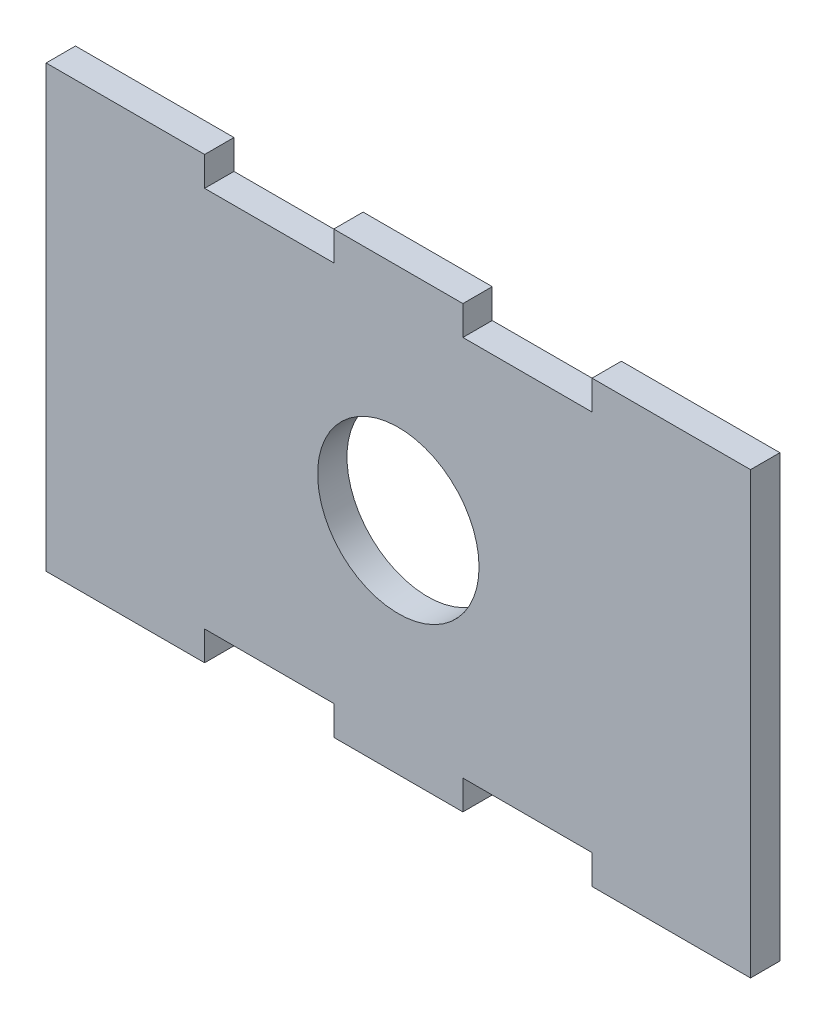
ISO-10303-21;
HEADER;
FILE_DESCRIPTION(('STEP AP214'),'2;1');
FILE_NAME('part.step','',(''),(''),'','','');
FILE_SCHEMA(('AUTOMOTIVE_DESIGN { 1 0 10303 214 1 1 1 1 }'));
ENDSEC;
DATA;
#1=APPLICATION_CONTEXT('core data for automotive mechanical design processes');
#2=APPLICATION_PROTOCOL_DEFINITION('international standard','automotive_design',2000,#1);
#3=PRODUCT_CONTEXT('',#1,'mechanical');
#4=PRODUCT('Part','Part','',(#3));
#5=PRODUCT_RELATED_PRODUCT_CATEGORY('part','',(#4));
#6=PRODUCT_DEFINITION_FORMATION('','',#4);
#7=PRODUCT_DEFINITION_CONTEXT('part definition',#1,'design');
#8=PRODUCT_DEFINITION('design','',#6,#7);
#9=PRODUCT_DEFINITION_SHAPE('','',#8);
#10=(LENGTH_UNIT() NAMED_UNIT(*) SI_UNIT(.MILLI.,.METRE.));
#11=(NAMED_UNIT(*) PLANE_ANGLE_UNIT() SI_UNIT($,.RADIAN.));
#12=(NAMED_UNIT(*) SI_UNIT($,.STERADIAN.) SOLID_ANGLE_UNIT());
#13=UNCERTAINTY_MEASURE_WITH_UNIT(LENGTH_MEASURE(1.E-05),#10,'distance_accuracy_value','');
#14=(GEOMETRIC_REPRESENTATION_CONTEXT(3) GLOBAL_UNCERTAINTY_ASSIGNED_CONTEXT((#13)) GLOBAL_UNIT_ASSIGNED_CONTEXT((#10,
#11,#12)) REPRESENTATION_CONTEXT('',''));
#15=CARTESIAN_POINT('',(0.,0.,0.));
#16=DIRECTION('',(0.,0.,1.));
#17=DIRECTION('',(1.,0.,0.));
#18=AXIS2_PLACEMENT_3D('',#15,#16,#17);
#19=CARTESIAN_POINT('',(0.,0.,4.));
#20=DIRECTION('',(0.,0.,-1.));
#21=DIRECTION('',(-1.,0.,0.));
#22=AXIS2_PLACEMENT_3D('',#19,#20,#21);
#23=PLANE('',#22);
#24=DIRECTION('',(-1.,0.,0.));
#25=VECTOR('',#24,1.);
#26=CARTESIAN_POINT('',(20.5241149653942,38.3611111111111,4.));
#27=LINE('',#26,#25);
#28=CARTESIAN_POINT('',(20.5241149653942,38.3611111111111,4.));
#29=VERTEX_POINT('',#28);
#30=CARTESIAN_POINT('',(2.92411496539427,38.3611111111111,4.));
#31=VERTEX_POINT('',#30);
#32=EDGE_CURVE('E318',#29,#31,#27,.T.);
#33=ORIENTED_EDGE('',*,*,#32,.T.);
#34=DIRECTION('',(0.,1.,0.));
#35=VECTOR('',#34,1.);
#36=CARTESIAN_POINT('',(2.92411496539427,38.3611111111111,4.));
#37=LINE('',#36,#35);
#38=CARTESIAN_POINT('',(2.92411496539427,42.3611111111111,4.));
#39=VERTEX_POINT('',#38);
#40=EDGE_CURVE('E190',#31,#39,#37,.T.);
#41=ORIENTED_EDGE('',*,*,#40,.T.);
#42=DIRECTION('',(1.,0.,0.));
#43=VECTOR('',#42,1.);
#44=CARTESIAN_POINT('',(-14.6758850346059,42.3611111111111,4.));
#45=LINE('',#44,#43);
#46=CARTESIAN_POINT('',(-14.6758850346059,42.3611111111111,4.));
#47=VERTEX_POINT('',#46);
#48=EDGE_CURVE('E358',#47,#39,#45,.T.);
#49=ORIENTED_EDGE('',*,*,#48,.F.);
#50=DIRECTION('',(0.,-1.,0.));
#51=VECTOR('',#50,1.);
#52=CARTESIAN_POINT('',(-14.6758850346059,42.3611111111111,4.));
#53=LINE('',#52,#51);
#54=CARTESIAN_POINT('',(-14.6758850346058,38.3611111111111,4.));
#55=VERTEX_POINT('',#54);
#56=EDGE_CURVE('E379',#47,#55,#53,.T.);
#57=ORIENTED_EDGE('',*,*,#56,.T.);
#58=DIRECTION('',(-1.,0.,0.));
#59=VECTOR('',#58,1.);
#60=CARTESIAN_POINT('',(-14.6758850346058,38.3611111111111,4.));
#61=LINE('',#60,#59);
#62=CARTESIAN_POINT('',(-32.2758850346057,38.3611111111111,4.));
#63=VERTEX_POINT('',#62);
#64=EDGE_CURVE('E376',#55,#63,#61,.T.);
#65=ORIENTED_EDGE('',*,*,#64,.T.);
#66=DIRECTION('',(0.,1.,0.));
#67=VECTOR('',#66,1.);
#68=CARTESIAN_POINT('',(-32.2758850346057,38.3611111111111,4.));
#69=LINE('',#68,#67);
#70=CARTESIAN_POINT('',(-32.2758850346057,42.3611111111111,4.));
#71=VERTEX_POINT('',#70);
#72=EDGE_CURVE('E378',#63,#71,#69,.T.);
#73=ORIENTED_EDGE('',*,*,#72,.T.);
#74=DIRECTION('',(1.,0.,0.));
#75=VECTOR('',#74,1.);
#76=CARTESIAN_POINT('',(-53.8758850346058,42.3611111111111,4.));
#77=LINE('',#76,#75);
#78=CARTESIAN_POINT('',(-53.8758850346058,42.3611111111111,4.));
#79=VERTEX_POINT('',#78);
#80=EDGE_CURVE('E381',#79,#71,#77,.T.);
#81=ORIENTED_EDGE('',*,*,#80,.F.);
#82=DIRECTION('',(0.,-1.,0.));
#83=VECTOR('',#82,1.);
#84=CARTESIAN_POINT('',(-53.8758850346058,42.3611111111111,4.));
#85=LINE('',#84,#83);
#86=CARTESIAN_POINT('',(-53.8758850346058,-17.6388888888889,4.));
#87=VERTEX_POINT('',#86);
#88=EDGE_CURVE('E388',#79,#87,#85,.T.);
#89=ORIENTED_EDGE('',*,*,#88,.T.);
#90=DIRECTION('',(1.,0.,0.));
#91=VECTOR('',#90,1.);
#92=CARTESIAN_POINT('',(-53.8758850346058,-17.6388888888889,4.));
#93=LINE('',#92,#91);
#94=CARTESIAN_POINT('',(-32.2758850346057,-17.6388888888889,4.));
#95=VERTEX_POINT('',#94);
#96=EDGE_CURVE('E390',#87,#95,#93,.T.);
#97=ORIENTED_EDGE('',*,*,#96,.T.);
#98=DIRECTION('',(0.,1.,0.));
#99=VECTOR('',#98,1.);
#100=CARTESIAN_POINT('',(-32.2758850346057,-17.6388888888889,4.));
#101=LINE('',#100,#99);
#102=CARTESIAN_POINT('',(-32.2758850346057,-13.6388888888889,4.));
#103=VERTEX_POINT('',#102);
#104=EDGE_CURVE('E392',#95,#103,#101,.T.);
#105=ORIENTED_EDGE('',*,*,#104,.T.);
#106=DIRECTION('',(-1.,0.,0.));
#107=VECTOR('',#106,1.);
#108=CARTESIAN_POINT('',(-14.6758850346058,-13.6388888888889,4.));
#109=LINE('',#108,#107);
#110=CARTESIAN_POINT('',(-14.6758850346058,-13.6388888888889,4.));
#111=VERTEX_POINT('',#110);
#112=EDGE_CURVE('E394',#111,#103,#109,.T.);
#113=ORIENTED_EDGE('',*,*,#112,.F.);
#114=DIRECTION('',(0.,1.,0.));
#115=VECTOR('',#114,1.);
#116=CARTESIAN_POINT('',(-14.6758850346058,-17.6388888888889,4.));
#117=LINE('',#116,#115);
#118=CARTESIAN_POINT('',(-14.6758850346058,-17.6388888888889,4.));
#119=VERTEX_POINT('',#118);
#120=EDGE_CURVE('E397',#119,#111,#117,.T.);
#121=ORIENTED_EDGE('',*,*,#120,.F.);
#122=DIRECTION('',(1.,0.,0.));
#123=VECTOR('',#122,1.);
#124=CARTESIAN_POINT('',(-14.6758850346058,-17.6388888888889,4.));
#125=LINE('',#124,#123);
#126=CARTESIAN_POINT('',(2.92411496539428,-17.6388888888889,4.));
#127=VERTEX_POINT('',#126);
#128=EDGE_CURVE('E400',#119,#127,#125,.T.);
#129=ORIENTED_EDGE('',*,*,#128,.T.);
#130=DIRECTION('',(0.,-1.,0.));
#131=VECTOR('',#130,1.);
#132=CARTESIAN_POINT('',(2.92411496539427,-13.6388888888889,4.));
#133=LINE('',#132,#131);
#134=CARTESIAN_POINT('',(2.92411496539427,-13.6388888888889,4.));
#135=VERTEX_POINT('',#134);
#136=EDGE_CURVE('E402',#135,#127,#133,.T.);
#137=ORIENTED_EDGE('',*,*,#136,.F.);
#138=DIRECTION('',(-1.,0.,0.));
#139=VECTOR('',#138,1.);
#140=CARTESIAN_POINT('',(20.5241149653942,-13.6388888888889,4.));
#141=LINE('',#140,#139);
#142=CARTESIAN_POINT('',(20.5241149653942,-13.6388888888889,4.));
#143=VERTEX_POINT('',#142);
#144=EDGE_CURVE('E405',#143,#135,#141,.T.);
#145=ORIENTED_EDGE('',*,*,#144,.F.);
#146=DIRECTION('',(0.,1.,0.));
#147=VECTOR('',#146,1.);
#148=CARTESIAN_POINT('',(20.5241149653942,-17.6388888888889,4.));
#149=LINE('',#148,#147);
#150=CARTESIAN_POINT('',(20.5241149653942,-17.6388888888889,4.));
#151=VERTEX_POINT('',#150);
#152=EDGE_CURVE('E408',#151,#143,#149,.T.);
#153=ORIENTED_EDGE('',*,*,#152,.F.);
#154=DIRECTION('',(1.,0.,0.));
#155=VECTOR('',#154,1.);
#156=CARTESIAN_POINT('',(20.5241149653942,-17.6388888888889,4.));
#157=LINE('',#156,#155);
#158=CARTESIAN_POINT('',(42.1241149653942,-17.6388888888889,4.));
#159=VERTEX_POINT('',#158);
#160=EDGE_CURVE('E257',#151,#159,#157,.T.);
#161=ORIENTED_EDGE('',*,*,#160,.T.);
#162=DIRECTION('',(0.,-1.,0.));
#163=VECTOR('',#162,1.);
#164=CARTESIAN_POINT('',(42.1241149653943,42.3611111111111,4.));
#165=LINE('',#164,#163);
#166=CARTESIAN_POINT('',(42.1241149653943,42.3611111111111,4.));
#167=VERTEX_POINT('',#166);
#168=EDGE_CURVE('E244',#167,#159,#165,.T.);
#169=ORIENTED_EDGE('',*,*,#168,.F.);
#170=DIRECTION('',(1.,0.,0.));
#171=VECTOR('',#170,1.);
#172=CARTESIAN_POINT('',(20.5241149653942,42.3611111111111,4.));
#173=LINE('',#172,#171);
#174=CARTESIAN_POINT('',(20.5241149653942,42.3611111111111,4.));
#175=VERTEX_POINT('',#174);
#176=EDGE_CURVE('E254',#175,#167,#173,.T.);
#177=ORIENTED_EDGE('',*,*,#176,.F.);
#178=DIRECTION('',(0.,-1.,0.));
#179=VECTOR('',#178,1.);
#180=CARTESIAN_POINT('',(20.5241149653942,42.3611111111111,4.));
#181=LINE('',#180,#179);
#182=EDGE_CURVE('E115',#175,#29,#181,.T.);
#183=ORIENTED_EDGE('',*,*,#182,.T.);
#184=EDGE_LOOP('',(#33,#41,#49,#57,#65,#73,#81,#89,#97,#105,#113,#121,#129,#137,#145,#153,#161,
#169,#177,#183));
#185=FACE_BOUND('',#184,.T.);
#186=CARTESIAN_POINT('',(-5.87588503460576,12.3611111111111,4.));
#187=DIRECTION('',(0.,0.,1.));
#188=DIRECTION('',(1.,0.,0.));
#189=AXIS2_PLACEMENT_3D('',#186,#187,#188);
#190=CIRCLE('',#189,11.);
#191=CARTESIAN_POINT('',(5.12411496539424,12.3611111111111,4.));
#192=VERTEX_POINT('',#191);
#193=EDGE_CURVE('E270',#192,#192,#190,.T.);
#194=ORIENTED_EDGE('',*,*,#193,.F.);
#195=EDGE_LOOP('',(#194));
#196=FACE_BOUND('',#195,.T.);
#197=ADVANCED_FACE('F98',(#185,#196),#23,.F.);
#198=CARTESIAN_POINT('',(0.,0.,0.));
#199=DIRECTION('',(0.,0.,-1.));
#200=DIRECTION('',(-1.,0.,0.));
#201=AXIS2_PLACEMENT_3D('',#198,#199,#200);
#202=PLANE('',#201);
#203=DIRECTION('',(-1.,0.,0.));
#204=VECTOR('',#203,1.);
#205=CARTESIAN_POINT('',(20.5241149653942,38.3611111111111,0.));
#206=LINE('',#205,#204);
#207=CARTESIAN_POINT('',(20.5241149653942,38.3611111111111,0.));
#208=VERTEX_POINT('',#207);
#209=CARTESIAN_POINT('',(2.92411496539427,38.3611111111111,0.));
#210=VERTEX_POINT('',#209);
#211=EDGE_CURVE('E266',#208,#210,#206,.T.);
#212=ORIENTED_EDGE('',*,*,#211,.F.);
#213=DIRECTION('',(0.,-1.,0.));
#214=VECTOR('',#213,1.);
#215=CARTESIAN_POINT('',(20.5241149653942,42.3611111111111,0.));
#216=LINE('',#215,#214);
#217=CARTESIAN_POINT('',(20.5241149653942,42.3611111111111,0.));
#218=VERTEX_POINT('',#217);
#219=EDGE_CURVE('E182',#218,#208,#216,.T.);
#220=ORIENTED_EDGE('',*,*,#219,.F.);
#221=DIRECTION('',(1.,0.,0.));
#222=VECTOR('',#221,1.);
#223=CARTESIAN_POINT('',(20.5241149653942,42.3611111111111,0.));
#224=LINE('',#223,#222);
#225=CARTESIAN_POINT('',(42.1241149653943,42.3611111111111,0.));
#226=VERTEX_POINT('',#225);
#227=EDGE_CURVE('E315',#218,#226,#224,.T.);
#228=ORIENTED_EDGE('',*,*,#227,.T.);
#229=DIRECTION('',(0.,-1.,0.));
#230=VECTOR('',#229,1.);
#231=CARTESIAN_POINT('',(42.1241149653943,42.3611111111111,0.));
#232=LINE('',#231,#230);
#233=CARTESIAN_POINT('',(42.1241149653942,-17.6388888888889,0.));
#234=VERTEX_POINT('',#233);
#235=EDGE_CURVE('E246',#226,#234,#232,.T.);
#236=ORIENTED_EDGE('',*,*,#235,.T.);
#237=DIRECTION('',(1.,0.,0.));
#238=VECTOR('',#237,1.);
#239=CARTESIAN_POINT('',(20.5241149653942,-17.6388888888889,0.));
#240=LINE('',#239,#238);
#241=CARTESIAN_POINT('',(20.5241149653942,-17.6388888888889,0.));
#242=VERTEX_POINT('',#241);
#243=EDGE_CURVE('E311',#242,#234,#240,.T.);
#244=ORIENTED_EDGE('',*,*,#243,.F.);
#245=DIRECTION('',(0.,1.,0.));
#246=VECTOR('',#245,1.);
#247=CARTESIAN_POINT('',(20.5241149653942,-17.6388888888889,0.));
#248=LINE('',#247,#246);
#249=CARTESIAN_POINT('',(20.5241149653942,-13.6388888888889,0.));
#250=VERTEX_POINT('',#249);
#251=EDGE_CURVE('E308',#242,#250,#248,.T.);
#252=ORIENTED_EDGE('',*,*,#251,.T.);
#253=DIRECTION('',(-1.,0.,0.));
#254=VECTOR('',#253,1.);
#255=CARTESIAN_POINT('',(20.5241149653942,-13.6388888888889,0.));
#256=LINE('',#255,#254);
#257=CARTESIAN_POINT('',(2.92411496539427,-13.6388888888889,0.));
#258=VERTEX_POINT('',#257);
#259=EDGE_CURVE('E305',#250,#258,#256,.T.);
#260=ORIENTED_EDGE('',*,*,#259,.T.);
#261=DIRECTION('',(0.,-1.,0.));
#262=VECTOR('',#261,1.);
#263=CARTESIAN_POINT('',(2.92411496539427,-13.6388888888889,0.));
#264=LINE('',#263,#262);
#265=CARTESIAN_POINT('',(2.92411496539428,-17.6388888888889,0.));
#266=VERTEX_POINT('',#265);
#267=EDGE_CURVE('E302',#258,#266,#264,.T.);
#268=ORIENTED_EDGE('',*,*,#267,.T.);
#269=DIRECTION('',(1.,0.,0.));
#270=VECTOR('',#269,1.);
#271=CARTESIAN_POINT('',(-14.6758850346058,-17.6388888888889,0.));
#272=LINE('',#271,#270);
#273=CARTESIAN_POINT('',(-14.6758850346058,-17.6388888888889,0.));
#274=VERTEX_POINT('',#273);
#275=EDGE_CURVE('E299',#274,#266,#272,.T.);
#276=ORIENTED_EDGE('',*,*,#275,.F.);
#277=DIRECTION('',(0.,1.,0.));
#278=VECTOR('',#277,1.);
#279=CARTESIAN_POINT('',(-14.6758850346058,-17.6388888888889,0.));
#280=LINE('',#279,#278);
#281=CARTESIAN_POINT('',(-14.6758850346058,-13.6388888888889,0.));
#282=VERTEX_POINT('',#281);
#283=EDGE_CURVE('E296',#274,#282,#280,.T.);
#284=ORIENTED_EDGE('',*,*,#283,.T.);
#285=DIRECTION('',(-1.,0.,0.));
#286=VECTOR('',#285,1.);
#287=CARTESIAN_POINT('',(-14.6758850346058,-13.6388888888889,0.));
#288=LINE('',#287,#286);
#289=CARTESIAN_POINT('',(-32.2758850346057,-13.6388888888889,0.));
#290=VERTEX_POINT('',#289);
#291=EDGE_CURVE('E293',#282,#290,#288,.T.);
#292=ORIENTED_EDGE('',*,*,#291,.T.);
#293=DIRECTION('',(0.,1.,0.));
#294=VECTOR('',#293,1.);
#295=CARTESIAN_POINT('',(-32.2758850346057,-17.6388888888889,0.));
#296=LINE('',#295,#294);
#297=CARTESIAN_POINT('',(-32.2758850346057,-17.6388888888889,0.));
#298=VERTEX_POINT('',#297);
#299=EDGE_CURVE('E290',#298,#290,#296,.T.);
#300=ORIENTED_EDGE('',*,*,#299,.F.);
#301=DIRECTION('',(1.,0.,0.));
#302=VECTOR('',#301,1.);
#303=CARTESIAN_POINT('',(-53.8758850346058,-17.6388888888889,0.));
#304=LINE('',#303,#302);
#305=CARTESIAN_POINT('',(-53.8758850346058,-17.6388888888889,0.));
#306=VERTEX_POINT('',#305);
#307=EDGE_CURVE('E288',#306,#298,#304,.T.);
#308=ORIENTED_EDGE('',*,*,#307,.F.);
#309=DIRECTION('',(0.,-1.,0.));
#310=VECTOR('',#309,1.);
#311=CARTESIAN_POINT('',(-53.8758850346058,42.3611111111111,0.));
#312=LINE('',#311,#310);
#313=CARTESIAN_POINT('',(-53.8758850346058,42.3611111111111,0.));
#314=VERTEX_POINT('',#313);
#315=EDGE_CURVE('E286',#314,#306,#312,.T.);
#316=ORIENTED_EDGE('',*,*,#315,.F.);
#317=DIRECTION('',(1.,0.,0.));
#318=VECTOR('',#317,1.);
#319=CARTESIAN_POINT('',(-53.8758850346058,42.3611111111111,0.));
#320=LINE('',#319,#318);
#321=CARTESIAN_POINT('',(-32.2758850346057,42.3611111111111,0.));
#322=VERTEX_POINT('',#321);
#323=EDGE_CURVE('E283',#314,#322,#320,.T.);
#324=ORIENTED_EDGE('',*,*,#323,.T.);
#325=DIRECTION('',(0.,1.,0.));
#326=VECTOR('',#325,1.);
#327=CARTESIAN_POINT('',(-32.2758850346057,38.3611111111111,0.));
#328=LINE('',#327,#326);
#329=CARTESIAN_POINT('',(-32.2758850346057,38.3611111111111,0.));
#330=VERTEX_POINT('',#329);
#331=EDGE_CURVE('E280',#330,#322,#328,.T.);
#332=ORIENTED_EDGE('',*,*,#331,.F.);
#333=DIRECTION('',(-1.,0.,0.));
#334=VECTOR('',#333,1.);
#335=CARTESIAN_POINT('',(-14.6758850346058,38.3611111111111,0.));
#336=LINE('',#335,#334);
#337=CARTESIAN_POINT('',(-14.6758850346058,38.3611111111111,0.));
#338=VERTEX_POINT('',#337);
#339=EDGE_CURVE('E278',#338,#330,#336,.T.);
#340=ORIENTED_EDGE('',*,*,#339,.F.);
#341=DIRECTION('',(0.,-1.,0.));
#342=VECTOR('',#341,1.);
#343=CARTESIAN_POINT('',(-14.6758850346059,42.3611111111111,0.));
#344=LINE('',#343,#342);
#345=CARTESIAN_POINT('',(-14.6758850346059,42.3611111111111,0.));
#346=VERTEX_POINT('',#345);
#347=EDGE_CURVE('E276',#346,#338,#344,.T.);
#348=ORIENTED_EDGE('',*,*,#347,.F.);
#349=DIRECTION('',(1.,0.,0.));
#350=VECTOR('',#349,1.);
#351=CARTESIAN_POINT('',(-14.6758850346059,42.3611111111111,0.));
#352=LINE('',#351,#350);
#353=CARTESIAN_POINT('',(2.92411496539427,42.3611111111111,0.));
#354=VERTEX_POINT('',#353);
#355=EDGE_CURVE('E273',#346,#354,#352,.T.);
#356=ORIENTED_EDGE('',*,*,#355,.T.);
#357=DIRECTION('',(0.,1.,0.));
#358=VECTOR('',#357,1.);
#359=CARTESIAN_POINT('',(2.92411496539427,38.3611111111111,0.));
#360=LINE('',#359,#358);
#361=EDGE_CURVE('E269',#210,#354,#360,.T.);
#362=ORIENTED_EDGE('',*,*,#361,.F.);
#363=EDGE_LOOP('',(#212,#220,#228,#236,#244,#252,#260,#268,#276,#284,#292,#300,#308,#316,#324,
#332,#340,#348,#356,#362));
#364=FACE_BOUND('',#363,.T.);
#365=CARTESIAN_POINT('',(-5.87588503460576,12.3611111111111,0.));
#366=DIRECTION('',(0.,0.,1.));
#367=DIRECTION('',(1.,0.,0.));
#368=AXIS2_PLACEMENT_3D('',#365,#366,#367);
#369=CIRCLE('',#368,11.);
#370=CARTESIAN_POINT('',(5.12411496539424,12.3611111111111,0.));
#371=VERTEX_POINT('',#370);
#372=EDGE_CURVE('E630',#371,#371,#369,.T.);
#373=ORIENTED_EDGE('',*,*,#372,.T.);
#374=EDGE_LOOP('',(#373));
#375=FACE_BOUND('',#374,.T.);
#376=ADVANCED_FACE('F364',(#364,#375),#202,.T.);
#377=CARTESIAN_POINT('',(20.5241149653942,38.3611111111111,4.));
#378=DIRECTION('',(0.,-1.,0.));
#379=DIRECTION('',(0.,0.,-1.));
#380=AXIS2_PLACEMENT_3D('',#377,#378,#379);
#381=PLANE('',#380);
#382=ORIENTED_EDGE('',*,*,#211,.T.);
#383=DIRECTION('',(0.,0.,-1.));
#384=VECTOR('',#383,1.);
#385=CARTESIAN_POINT('',(2.92411496539427,38.3611111111111,4.));
#386=LINE('',#385,#384);
#387=EDGE_CURVE('E12',#31,#210,#386,.T.);
#388=ORIENTED_EDGE('',*,*,#387,.F.);
#389=ORIENTED_EDGE('',*,*,#32,.F.);
#390=DIRECTION('',(0.,0.,-1.));
#391=VECTOR('',#390,1.);
#392=CARTESIAN_POINT('',(20.5241149653942,38.3611111111111,4.));
#393=LINE('',#392,#391);
#394=EDGE_CURVE('E262',#29,#208,#393,.T.);
#395=ORIENTED_EDGE('',*,*,#394,.T.);
#396=EDGE_LOOP('',(#382,#388,#389,#395));
#397=FACE_BOUND('',#396,.T.);
#398=ADVANCED_FACE('F100',(#397),#381,.F.);
#399=CARTESIAN_POINT('',(2.92411496539427,38.3611111111111,4.));
#400=DIRECTION('',(-1.,0.,0.));
#401=DIRECTION('',(0.,0.,1.));
#402=AXIS2_PLACEMENT_3D('',#399,#400,#401);
#403=PLANE('',#402);
#404=ORIENTED_EDGE('',*,*,#361,.T.);
#405=DIRECTION('',(0.,0.,-1.));
#406=VECTOR('',#405,1.);
#407=CARTESIAN_POINT('',(2.92411496539427,42.3611111111111,4.));
#408=LINE('',#407,#406);
#409=EDGE_CURVE('E107',#39,#354,#408,.T.);
#410=ORIENTED_EDGE('',*,*,#409,.F.);
#411=ORIENTED_EDGE('',*,*,#40,.F.);
#412=ORIENTED_EDGE('',*,*,#387,.T.);
#413=EDGE_LOOP('',(#404,#410,#411,#412));
#414=FACE_BOUND('',#413,.T.);
#415=ADVANCED_FACE('F359',(#414),#403,.F.);
#416=CARTESIAN_POINT('',(-14.6758850346059,42.3611111111111,4.));
#417=DIRECTION('',(0.,1.,0.));
#418=DIRECTION('',(0.,0.,1.));
#419=AXIS2_PLACEMENT_3D('',#416,#417,#418);
#420=PLANE('',#419);
#421=ORIENTED_EDGE('',*,*,#355,.F.);
#422=DIRECTION('',(0.,0.,-1.));
#423=VECTOR('',#422,1.);
#424=CARTESIAN_POINT('',(-14.6758850346059,42.3611111111111,4.));
#425=LINE('',#424,#423);
#426=EDGE_CURVE('E352',#47,#346,#425,.T.);
#427=ORIENTED_EDGE('',*,*,#426,.F.);
#428=ORIENTED_EDGE('',*,*,#48,.T.);
#429=ORIENTED_EDGE('',*,*,#409,.T.);
#430=EDGE_LOOP('',(#421,#427,#428,#429));
#431=FACE_BOUND('',#430,.T.);
#432=ADVANCED_FACE('F356',(#431),#420,.T.);
#433=CARTESIAN_POINT('',(-14.6758850346059,42.3611111111111,4.));
#434=DIRECTION('',(1.,0.,0.));
#435=DIRECTION('',(0.,1.,0.));
#436=AXIS2_PLACEMENT_3D('',#433,#434,#435);
#437=PLANE('',#436);
#438=ORIENTED_EDGE('',*,*,#347,.T.);
#439=DIRECTION('',(0.,0.,-1.));
#440=VECTOR('',#439,1.);
#441=CARTESIAN_POINT('',(-14.6758850346058,38.3611111111111,4.));
#442=LINE('',#441,#440);
#443=EDGE_CURVE('E349',#55,#338,#442,.T.);
#444=ORIENTED_EDGE('',*,*,#443,.F.);
#445=ORIENTED_EDGE('',*,*,#56,.F.);
#446=ORIENTED_EDGE('',*,*,#426,.T.);
#447=EDGE_LOOP('',(#438,#444,#445,#446));
#448=FACE_BOUND('',#447,.T.);
#449=ADVANCED_FACE('F370',(#448),#437,.F.);
#450=CARTESIAN_POINT('',(-14.6758850346058,38.3611111111111,4.));
#451=DIRECTION('',(0.,-1.,0.));
#452=DIRECTION('',(0.,0.,-1.));
#453=AXIS2_PLACEMENT_3D('',#450,#451,#452);
#454=PLANE('',#453);
#455=ORIENTED_EDGE('',*,*,#339,.T.);
#456=DIRECTION('',(0.,0.,-1.));
#457=VECTOR('',#456,1.);
#458=CARTESIAN_POINT('',(-32.2758850346057,38.3611111111111,4.));
#459=LINE('',#458,#457);
#460=EDGE_CURVE('E346',#63,#330,#459,.T.);
#461=ORIENTED_EDGE('',*,*,#460,.F.);
#462=ORIENTED_EDGE('',*,*,#64,.F.);
#463=ORIENTED_EDGE('',*,*,#443,.T.);
#464=EDGE_LOOP('',(#455,#461,#462,#463));
#465=FACE_BOUND('',#464,.T.);
#466=ADVANCED_FACE('F374',(#465),#454,.F.);
#467=CARTESIAN_POINT('',(-32.2758850346057,38.3611111111111,4.));
#468=DIRECTION('',(-1.,0.,0.));
#469=DIRECTION('',(0.,0.,1.));
#470=AXIS2_PLACEMENT_3D('',#467,#468,#469);
#471=PLANE('',#470);
#472=ORIENTED_EDGE('',*,*,#331,.T.);
#473=DIRECTION('',(0.,0.,-1.));
#474=VECTOR('',#473,1.);
#475=CARTESIAN_POINT('',(-32.2758850346057,42.3611111111111,4.));
#476=LINE('',#475,#474);
#477=EDGE_CURVE('E344',#71,#322,#476,.T.);
#478=ORIENTED_EDGE('',*,*,#477,.F.);
#479=ORIENTED_EDGE('',*,*,#72,.F.);
#480=ORIENTED_EDGE('',*,*,#460,.T.);
#481=EDGE_LOOP('',(#472,#478,#479,#480));
#482=FACE_BOUND('',#481,.T.);
#483=ADVANCED_FACE('F555',(#482),#471,.F.);
#484=CARTESIAN_POINT('',(-53.8758850346058,42.3611111111111,4.));
#485=DIRECTION('',(0.,1.,0.));
#486=DIRECTION('',(0.,0.,1.));
#487=AXIS2_PLACEMENT_3D('',#484,#485,#486);
#488=PLANE('',#487);
#489=ORIENTED_EDGE('',*,*,#323,.F.);
#490=DIRECTION('',(0.,0.,-1.));
#491=VECTOR('',#490,1.);
#492=CARTESIAN_POINT('',(-53.8758850346058,42.3611111111111,4.));
#493=LINE('',#492,#491);
#494=EDGE_CURVE('E342',#79,#314,#493,.T.);
#495=ORIENTED_EDGE('',*,*,#494,.F.);
#496=ORIENTED_EDGE('',*,*,#80,.T.);
#497=ORIENTED_EDGE('',*,*,#477,.T.);
#498=EDGE_LOOP('',(#489,#495,#496,#497));
#499=FACE_BOUND('',#498,.T.);
#500=ADVANCED_FACE('F546',(#499),#488,.T.);
#501=CARTESIAN_POINT('',(-53.8758850346058,42.3611111111111,4.));
#502=DIRECTION('',(1.,0.,0.));
#503=DIRECTION('',(0.,1.,0.));
#504=AXIS2_PLACEMENT_3D('',#501,#502,#503);
#505=PLANE('',#504);
#506=ORIENTED_EDGE('',*,*,#315,.T.);
#507=DIRECTION('',(0.,0.,-1.));
#508=VECTOR('',#507,1.);
#509=CARTESIAN_POINT('',(-53.8758850346058,-17.6388888888889,4.));
#510=LINE('',#509,#508);
#511=EDGE_CURVE('E339',#87,#306,#510,.T.);
#512=ORIENTED_EDGE('',*,*,#511,.F.);
#513=ORIENTED_EDGE('',*,*,#88,.F.);
#514=ORIENTED_EDGE('',*,*,#494,.T.);
#515=EDGE_LOOP('',(#506,#512,#513,#514));
#516=FACE_BOUND('',#515,.T.);
#517=ADVANCED_FACE('F537',(#516),#505,.F.);
#518=CARTESIAN_POINT('',(-53.8758850346058,-17.6388888888889,4.));
#519=DIRECTION('',(0.,1.,0.));
#520=DIRECTION('',(0.,0.,1.));
#521=AXIS2_PLACEMENT_3D('',#518,#519,#520);
#522=PLANE('',#521);
#523=ORIENTED_EDGE('',*,*,#307,.T.);
#524=DIRECTION('',(0.,0.,-1.));
#525=VECTOR('',#524,1.);
#526=CARTESIAN_POINT('',(-32.2758850346057,-17.6388888888889,4.));
#527=LINE('',#526,#525);
#528=EDGE_CURVE('E336',#95,#298,#527,.T.);
#529=ORIENTED_EDGE('',*,*,#528,.F.);
#530=ORIENTED_EDGE('',*,*,#96,.F.);
#531=ORIENTED_EDGE('',*,*,#511,.T.);
#532=EDGE_LOOP('',(#523,#529,#530,#531));
#533=FACE_BOUND('',#532,.T.);
#534=ADVANCED_FACE('F528',(#533),#522,.F.);
#535=CARTESIAN_POINT('',(-32.2758850346057,-17.6388888888889,4.));
#536=DIRECTION('',(-1.,0.,0.));
#537=DIRECTION('',(0.,0.,1.));
#538=AXIS2_PLACEMENT_3D('',#535,#536,#537);
#539=PLANE('',#538);
#540=ORIENTED_EDGE('',*,*,#299,.T.);
#541=DIRECTION('',(0.,0.,-1.));
#542=VECTOR('',#541,1.);
#543=CARTESIAN_POINT('',(-32.2758850346057,-13.6388888888889,4.));
#544=LINE('',#543,#542);
#545=EDGE_CURVE('E334',#103,#290,#544,.T.);
#546=ORIENTED_EDGE('',*,*,#545,.F.);
#547=ORIENTED_EDGE('',*,*,#104,.F.);
#548=ORIENTED_EDGE('',*,*,#528,.T.);
#549=EDGE_LOOP('',(#540,#546,#547,#548));
#550=FACE_BOUND('',#549,.T.);
#551=ADVANCED_FACE('F519',(#550),#539,.F.);
#552=CARTESIAN_POINT('',(-14.6758850346058,-13.6388888888889,4.));
#553=DIRECTION('',(0.,-1.,0.));
#554=DIRECTION('',(0.,0.,-1.));
#555=AXIS2_PLACEMENT_3D('',#552,#553,#554);
#556=PLANE('',#555);
#557=ORIENTED_EDGE('',*,*,#291,.F.);
#558=DIRECTION('',(0.,0.,-1.));
#559=VECTOR('',#558,1.);
#560=CARTESIAN_POINT('',(-14.6758850346058,-13.6388888888889,4.));
#561=LINE('',#560,#559);
#562=EDGE_CURVE('E332',#111,#282,#561,.T.);
#563=ORIENTED_EDGE('',*,*,#562,.F.);
#564=ORIENTED_EDGE('',*,*,#112,.T.);
#565=ORIENTED_EDGE('',*,*,#545,.T.);
#566=EDGE_LOOP('',(#557,#563,#564,#565));
#567=FACE_BOUND('',#566,.T.);
#568=ADVANCED_FACE('F510',(#567),#556,.T.);
#569=CARTESIAN_POINT('',(-14.6758850346058,-17.6388888888889,4.));
#570=DIRECTION('',(-1.,0.,0.));
#571=DIRECTION('',(0.,-1.,0.));
#572=AXIS2_PLACEMENT_3D('',#569,#570,#571);
#573=PLANE('',#572);
#574=ORIENTED_EDGE('',*,*,#283,.F.);
#575=DIRECTION('',(0.,0.,-1.));
#576=VECTOR('',#575,1.);
#577=CARTESIAN_POINT('',(-14.6758850346058,-17.6388888888889,4.));
#578=LINE('',#577,#576);
#579=EDGE_CURVE('E330',#119,#274,#578,.T.);
#580=ORIENTED_EDGE('',*,*,#579,.F.);
#581=ORIENTED_EDGE('',*,*,#120,.T.);
#582=ORIENTED_EDGE('',*,*,#562,.T.);
#583=EDGE_LOOP('',(#574,#580,#581,#582));
#584=FACE_BOUND('',#583,.T.);
#585=ADVANCED_FACE('F501',(#584),#573,.T.);
#586=CARTESIAN_POINT('',(-14.6758850346058,-17.6388888888889,4.));
#587=DIRECTION('',(0.,1.,0.));
#588=DIRECTION('',(0.,0.,1.));
#589=AXIS2_PLACEMENT_3D('',#586,#587,#588);
#590=PLANE('',#589);
#591=ORIENTED_EDGE('',*,*,#275,.T.);
#592=DIRECTION('',(0.,0.,-1.));
#593=VECTOR('',#592,1.);
#594=CARTESIAN_POINT('',(2.92411496539428,-17.6388888888889,4.));
#595=LINE('',#594,#593);
#596=EDGE_CURVE('E328',#127,#266,#595,.T.);
#597=ORIENTED_EDGE('',*,*,#596,.F.);
#598=ORIENTED_EDGE('',*,*,#128,.F.);
#599=ORIENTED_EDGE('',*,*,#579,.T.);
#600=EDGE_LOOP('',(#591,#597,#598,#599));
#601=FACE_BOUND('',#600,.T.);
#602=ADVANCED_FACE('F492',(#601),#590,.F.);
#603=CARTESIAN_POINT('',(2.92411496539427,-13.6388888888889,4.));
#604=DIRECTION('',(1.,0.,0.));
#605=DIRECTION('',(0.,1.,0.));
#606=AXIS2_PLACEMENT_3D('',#603,#604,#605);
#607=PLANE('',#606);
#608=ORIENTED_EDGE('',*,*,#267,.F.);
#609=DIRECTION('',(0.,0.,-1.));
#610=VECTOR('',#609,1.);
#611=CARTESIAN_POINT('',(2.92411496539427,-13.6388888888889,4.));
#612=LINE('',#611,#610);
#613=EDGE_CURVE('E326',#135,#258,#612,.T.);
#614=ORIENTED_EDGE('',*,*,#613,.F.);
#615=ORIENTED_EDGE('',*,*,#136,.T.);
#616=ORIENTED_EDGE('',*,*,#596,.T.);
#617=EDGE_LOOP('',(#608,#614,#615,#616));
#618=FACE_BOUND('',#617,.T.);
#619=ADVANCED_FACE('F484',(#618),#607,.T.);
#620=CARTESIAN_POINT('',(20.5241149653942,-13.6388888888889,4.));
#621=DIRECTION('',(0.,-1.,0.));
#622=DIRECTION('',(0.,0.,-1.));
#623=AXIS2_PLACEMENT_3D('',#620,#621,#622);
#624=PLANE('',#623);
#625=ORIENTED_EDGE('',*,*,#259,.F.);
#626=DIRECTION('',(0.,0.,-1.));
#627=VECTOR('',#626,1.);
#628=CARTESIAN_POINT('',(20.5241149653942,-13.6388888888889,4.));
#629=LINE('',#628,#627);
#630=EDGE_CURVE('E324',#143,#250,#629,.T.);
#631=ORIENTED_EDGE('',*,*,#630,.F.);
#632=ORIENTED_EDGE('',*,*,#144,.T.);
#633=ORIENTED_EDGE('',*,*,#613,.T.);
#634=EDGE_LOOP('',(#625,#631,#632,#633));
#635=FACE_BOUND('',#634,.T.);
#636=ADVANCED_FACE('F417',(#635),#624,.T.);
#637=CARTESIAN_POINT('',(20.5241149653942,-17.6388888888889,4.));
#638=DIRECTION('',(-1.,0.,0.));
#639=DIRECTION('',(0.,-1.,0.));
#640=AXIS2_PLACEMENT_3D('',#637,#638,#639);
#641=PLANE('',#640);
#642=ORIENTED_EDGE('',*,*,#251,.F.);
#643=DIRECTION('',(0.,0.,-1.));
#644=VECTOR('',#643,1.);
#645=CARTESIAN_POINT('',(20.5241149653942,-17.6388888888889,4.));
#646=LINE('',#645,#644);
#647=EDGE_CURVE('E322',#151,#242,#646,.T.);
#648=ORIENTED_EDGE('',*,*,#647,.F.);
#649=ORIENTED_EDGE('',*,*,#152,.T.);
#650=ORIENTED_EDGE('',*,*,#630,.T.);
#651=EDGE_LOOP('',(#642,#648,#649,#650));
#652=FACE_BOUND('',#651,.T.);
#653=ADVANCED_FACE('F412',(#652),#641,.T.);
#654=CARTESIAN_POINT('',(20.5241149653942,-17.6388888888889,4.));
#655=DIRECTION('',(0.,1.,0.));
#656=DIRECTION('',(0.,0.,1.));
#657=AXIS2_PLACEMENT_3D('',#654,#655,#656);
#658=PLANE('',#657);
#659=ORIENTED_EDGE('',*,*,#243,.T.);
#660=DIRECTION('',(0.,0.,-1.));
#661=VECTOR('',#660,1.);
#662=CARTESIAN_POINT('',(42.1241149653942,-17.6388888888889,4.));
#663=LINE('',#662,#661);
#664=EDGE_CURVE('E251',#159,#234,#663,.T.);
#665=ORIENTED_EDGE('',*,*,#664,.F.);
#666=ORIENTED_EDGE('',*,*,#160,.F.);
#667=ORIENTED_EDGE('',*,*,#647,.T.);
#668=EDGE_LOOP('',(#659,#665,#666,#667));
#669=FACE_BOUND('',#668,.T.);
#670=ADVANCED_FACE('F421',(#669),#658,.F.);
#671=CARTESIAN_POINT('',(42.1241149653943,42.3611111111111,4.));
#672=DIRECTION('',(1.,0.,0.));
#673=DIRECTION('',(0.,1.,0.));
#674=AXIS2_PLACEMENT_3D('',#671,#672,#673);
#675=PLANE('',#674);
#676=ORIENTED_EDGE('',*,*,#235,.F.);
#677=DIRECTION('',(0.,0.,-1.));
#678=VECTOR('',#677,1.);
#679=CARTESIAN_POINT('',(42.1241149653943,42.3611111111111,4.));
#680=LINE('',#679,#678);
#681=EDGE_CURVE('E241',#167,#226,#680,.T.);
#682=ORIENTED_EDGE('',*,*,#681,.F.);
#683=ORIENTED_EDGE('',*,*,#168,.T.);
#684=ORIENTED_EDGE('',*,*,#664,.T.);
#685=EDGE_LOOP('',(#676,#682,#683,#684));
#686=FACE_BOUND('',#685,.T.);
#687=ADVANCED_FACE('F243',(#686),#675,.T.);
#688=CARTESIAN_POINT('',(20.5241149653942,42.3611111111111,4.));
#689=DIRECTION('',(0.,1.,0.));
#690=DIRECTION('',(0.,0.,1.));
#691=AXIS2_PLACEMENT_3D('',#688,#689,#690);
#692=PLANE('',#691);
#693=ORIENTED_EDGE('',*,*,#227,.F.);
#694=DIRECTION('',(0.,0.,-1.));
#695=VECTOR('',#694,1.);
#696=CARTESIAN_POINT('',(20.5241149653942,42.3611111111111,4.));
#697=LINE('',#696,#695);
#698=EDGE_CURVE('E179',#175,#218,#697,.T.);
#699=ORIENTED_EDGE('',*,*,#698,.F.);
#700=ORIENTED_EDGE('',*,*,#176,.T.);
#701=ORIENTED_EDGE('',*,*,#681,.T.);
#702=EDGE_LOOP('',(#693,#699,#700,#701));
#703=FACE_BOUND('',#702,.T.);
#704=ADVANCED_FACE('F260',(#703),#692,.T.);
#705=CARTESIAN_POINT('',(20.5241149653942,42.3611111111111,4.));
#706=DIRECTION('',(1.,0.,0.));
#707=DIRECTION('',(0.,1.,0.));
#708=AXIS2_PLACEMENT_3D('',#705,#706,#707);
#709=PLANE('',#708);
#710=ORIENTED_EDGE('',*,*,#219,.T.);
#711=ORIENTED_EDGE('',*,*,#394,.F.);
#712=ORIENTED_EDGE('',*,*,#182,.F.);
#713=ORIENTED_EDGE('',*,*,#698,.T.);
#714=EDGE_LOOP('',(#710,#711,#712,#713));
#715=FACE_BOUND('',#714,.T.);
#716=ADVANCED_FACE('F439',(#715),#709,.F.);
#717=CARTESIAN_POINT('',(-5.87588503460576,12.3611111111111,4.));
#718=DIRECTION('',(0.,0.,-1.));
#719=DIRECTION('',(-1.,0.,0.));
#720=AXIS2_PLACEMENT_3D('',#717,#718,#719);
#721=CYLINDRICAL_SURFACE('',#720,11.);
#722=ORIENTED_EDGE('',*,*,#193,.T.);
#723=EDGE_LOOP('',(#722));
#724=FACE_BOUND('',#723,.T.);
#725=ORIENTED_EDGE('',*,*,#372,.F.);
#726=EDGE_LOOP('',(#725));
#727=FACE_BOUND('',#726,.T.);
#728=ADVANCED_FACE('F437',(#724,#727),#721,.F.);
#729=CLOSED_SHELL('',(#197,#376,#398,#415,#432,#449,#466,#483,#500,#517,#534,#551,#568,#585,
#602,#619,#636,#653,#670,#687,#704,#716,#728));
#730=MANIFOLD_SOLID_BREP('B2',#729);
#731=ADVANCED_BREP_SHAPE_REPRESENTATION('',(#18,#730),#14);
#732=SHAPE_DEFINITION_REPRESENTATION(#9,#731);
ENDSEC;
END-ISO-10303-21;
